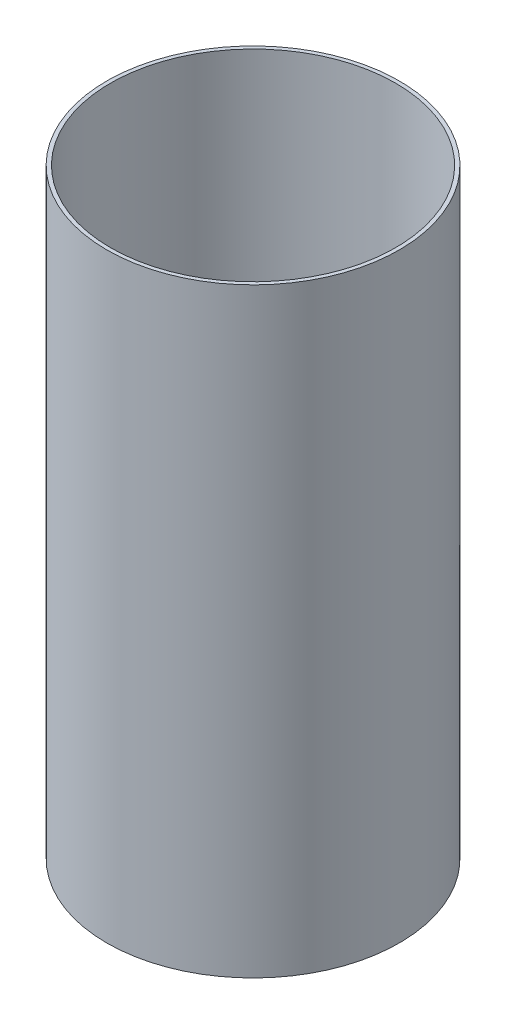
ISO-10303-21;
HEADER;
FILE_DESCRIPTION(('STEP AP214'),'2;1');
FILE_NAME('part.step','',(''),(''),'','','');
FILE_SCHEMA(('AUTOMOTIVE_DESIGN { 1 0 10303 214 1 1 1 1 }'));
ENDSEC;
DATA;
#1=APPLICATION_CONTEXT('core data for automotive mechanical design processes');
#2=APPLICATION_PROTOCOL_DEFINITION('international standard','automotive_design',2000,#1);
#3=PRODUCT_CONTEXT('',#1,'mechanical');
#4=PRODUCT('Part','Part','',(#3));
#5=PRODUCT_RELATED_PRODUCT_CATEGORY('part','',(#4));
#6=PRODUCT_DEFINITION_FORMATION('','',#4);
#7=PRODUCT_DEFINITION_CONTEXT('part definition',#1,'design');
#8=PRODUCT_DEFINITION('design','',#6,#7);
#9=PRODUCT_DEFINITION_SHAPE('','',#8);
#10=(LENGTH_UNIT() NAMED_UNIT(*) SI_UNIT(.MILLI.,.METRE.));
#11=(NAMED_UNIT(*) PLANE_ANGLE_UNIT() SI_UNIT($,.RADIAN.));
#12=(NAMED_UNIT(*) SI_UNIT($,.STERADIAN.) SOLID_ANGLE_UNIT());
#13=UNCERTAINTY_MEASURE_WITH_UNIT(LENGTH_MEASURE(1.E-05),#10,'distance_accuracy_value','');
#14=(GEOMETRIC_REPRESENTATION_CONTEXT(3) GLOBAL_UNCERTAINTY_ASSIGNED_CONTEXT((#13)) GLOBAL_UNIT_ASSIGNED_CONTEXT((#10,
#11,#12)) REPRESENTATION_CONTEXT('',''));
#15=CARTESIAN_POINT('',(0.,0.,0.));
#16=DIRECTION('',(0.,0.,1.));
#17=DIRECTION('',(1.,0.,0.));
#18=AXIS2_PLACEMENT_3D('',#15,#16,#17);
#19=CARTESIAN_POINT('',(0.,203.2,0.));
#20=DIRECTION('',(0.,1.,0.));
#21=DIRECTION('',(0.,0.,1.));
#22=AXIS2_PLACEMENT_3D('',#19,#20,#21);
#23=PLANE('',#22);
#24=CARTESIAN_POINT('',(0.,203.2,0.));
#25=DIRECTION('',(0.,1.,0.));
#26=DIRECTION('',(0.,0.,1.));
#27=AXIS2_PLACEMENT_3D('',#24,#25,#26);
#28=CIRCLE('',#27,49.53);
#29=CARTESIAN_POINT('',(0.,203.2,49.53));
#30=VERTEX_POINT('',#29);
#31=EDGE_CURVE('E10',#30,#30,#28,.T.);
#32=ORIENTED_EDGE('',*,*,#31,.T.);
#33=EDGE_LOOP('',(#32));
#34=FACE_BOUND('',#33,.T.);
#35=CARTESIAN_POINT('',(0.,203.2,0.));
#36=DIRECTION('',(0.,1.,0.));
#37=DIRECTION('',(0.,0.,1.));
#38=AXIS2_PLACEMENT_3D('',#35,#36,#37);
#39=CIRCLE('',#38,48.26);
#40=CARTESIAN_POINT('',(0.,203.2,48.26));
#41=VERTEX_POINT('',#40);
#42=EDGE_CURVE('E42',#41,#41,#39,.T.);
#43=ORIENTED_EDGE('',*,*,#42,.F.);
#44=EDGE_LOOP('',(#43));
#45=FACE_BOUND('',#44,.T.);
#46=ADVANCED_FACE('F31',(#34,#45),#23,.T.);
#47=CARTESIAN_POINT('',(0.,0.,0.));
#48=DIRECTION('',(0.,1.,0.));
#49=DIRECTION('',(0.,0.,1.));
#50=AXIS2_PLACEMENT_3D('',#47,#48,#49);
#51=PLANE('',#50);
#52=CARTESIAN_POINT('',(0.,0.,0.));
#53=DIRECTION('',(0.,1.,0.));
#54=DIRECTION('',(0.,0.,1.));
#55=AXIS2_PLACEMENT_3D('',#52,#53,#54);
#56=CIRCLE('',#55,49.53);
#57=CARTESIAN_POINT('',(0.,0.,49.53));
#58=VERTEX_POINT('',#57);
#59=EDGE_CURVE('E35',#58,#58,#56,.T.);
#60=ORIENTED_EDGE('',*,*,#59,.F.);
#61=EDGE_LOOP('',(#60));
#62=FACE_BOUND('',#61,.T.);
#63=CARTESIAN_POINT('',(0.,0.,0.));
#64=DIRECTION('',(0.,1.,0.));
#65=DIRECTION('',(0.,0.,1.));
#66=AXIS2_PLACEMENT_3D('',#63,#64,#65);
#67=CIRCLE('',#66,48.26);
#68=CARTESIAN_POINT('',(0.,0.,48.26));
#69=VERTEX_POINT('',#68);
#70=EDGE_CURVE('E44',#69,#69,#67,.T.);
#71=ORIENTED_EDGE('',*,*,#70,.T.);
#72=EDGE_LOOP('',(#71));
#73=FACE_BOUND('',#72,.T.);
#74=ADVANCED_FACE('F54',(#62,#73),#51,.F.);
#75=CARTESIAN_POINT('',(0.,203.2,0.));
#76=DIRECTION('',(0.,-1.,0.));
#77=DIRECTION('',(0.,0.,-1.));
#78=AXIS2_PLACEMENT_3D('',#75,#76,#77);
#79=CYLINDRICAL_SURFACE('',#78,49.53);
#80=ORIENTED_EDGE('',*,*,#31,.F.);
#81=EDGE_LOOP('',(#80));
#82=FACE_BOUND('',#81,.T.);
#83=ORIENTED_EDGE('',*,*,#59,.T.);
#84=EDGE_LOOP('',(#83));
#85=FACE_BOUND('',#84,.T.);
#86=ADVANCED_FACE('F33',(#82,#85),#79,.T.);
#87=CARTESIAN_POINT('',(0.,203.2,0.));
#88=DIRECTION('',(0.,-1.,0.));
#89=DIRECTION('',(0.,0.,-1.));
#90=AXIS2_PLACEMENT_3D('',#87,#88,#89);
#91=CYLINDRICAL_SURFACE('',#90,48.26);
#92=ORIENTED_EDGE('',*,*,#42,.T.);
#93=EDGE_LOOP('',(#92));
#94=FACE_BOUND('',#93,.T.);
#95=ORIENTED_EDGE('',*,*,#70,.F.);
#96=EDGE_LOOP('',(#95));
#97=FACE_BOUND('',#96,.T.);
#98=ADVANCED_FACE('F50',(#94,#97),#91,.F.);
#99=CLOSED_SHELL('',(#46,#74,#86,#98));
#100=MANIFOLD_SOLID_BREP('B2',#99);
#101=ADVANCED_BREP_SHAPE_REPRESENTATION('',(#18,#100),#14);
#102=SHAPE_DEFINITION_REPRESENTATION(#9,#101);
ENDSEC;
END-ISO-10303-21;
